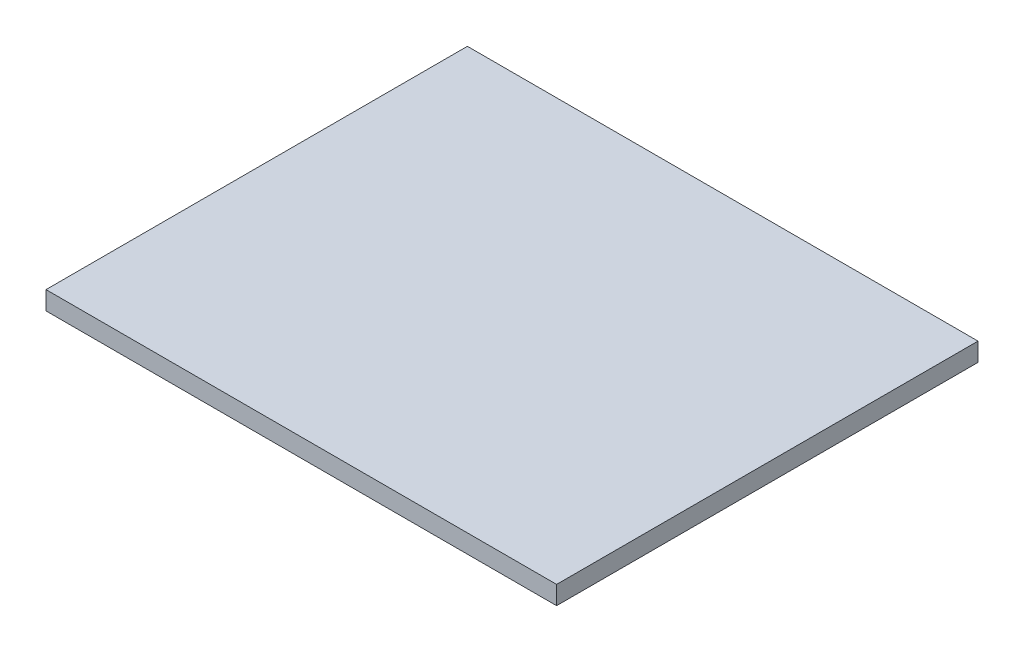
ISO-10303-21;
HEADER;
FILE_DESCRIPTION(('STEP AP214'),'2;1');
FILE_NAME('part.step','',(''),(''),'','','');
FILE_SCHEMA(('AUTOMOTIVE_DESIGN { 1 0 10303 214 1 1 1 1 }'));
ENDSEC;
DATA;
#1=APPLICATION_CONTEXT('core data for automotive mechanical design processes');
#2=APPLICATION_PROTOCOL_DEFINITION('international standard','automotive_design',2000,#1);
#3=PRODUCT_CONTEXT('',#1,'mechanical');
#4=PRODUCT('Part','Part','',(#3));
#5=PRODUCT_RELATED_PRODUCT_CATEGORY('part','',(#4));
#6=PRODUCT_DEFINITION_FORMATION('','',#4);
#7=PRODUCT_DEFINITION_CONTEXT('part definition',#1,'design');
#8=PRODUCT_DEFINITION('design','',#6,#7);
#9=PRODUCT_DEFINITION_SHAPE('','',#8);
#10=(LENGTH_UNIT() NAMED_UNIT(*) SI_UNIT(.MILLI.,.METRE.));
#11=(NAMED_UNIT(*) PLANE_ANGLE_UNIT() SI_UNIT($,.RADIAN.));
#12=(NAMED_UNIT(*) SI_UNIT($,.STERADIAN.) SOLID_ANGLE_UNIT());
#13=UNCERTAINTY_MEASURE_WITH_UNIT(LENGTH_MEASURE(1.E-05),#10,'distance_accuracy_value','');
#14=(GEOMETRIC_REPRESENTATION_CONTEXT(3) GLOBAL_UNCERTAINTY_ASSIGNED_CONTEXT((#13)) GLOBAL_UNIT_ASSIGNED_CONTEXT((#10,
#11,#12)) REPRESENTATION_CONTEXT('',''));
#15=CARTESIAN_POINT('',(0.,0.,0.));
#16=DIRECTION('',(0.,0.,1.));
#17=DIRECTION('',(1.,0.,0.));
#18=AXIS2_PLACEMENT_3D('',#15,#16,#17);
#19=CARTESIAN_POINT('',(124.8,-220.,68.5));
#20=DIRECTION('',(-1.,0.,0.));
#21=DIRECTION('',(0.,0.,1.));
#22=AXIS2_PLACEMENT_3D('',#19,#20,#21);
#23=PLANE('',#22);
#24=DIRECTION('',(0.,1.,0.));
#25=VECTOR('',#24,1.);
#26=CARTESIAN_POINT('',(124.8,-220.,0.));
#27=LINE('',#26,#25);
#28=CARTESIAN_POINT('',(124.8,-223.,0.));
#29=VERTEX_POINT('',#28);
#30=CARTESIAN_POINT('',(124.8,-220.,0.));
#31=VERTEX_POINT('',#30);
#32=EDGE_CURVE('E96',#29,#31,#27,.T.);
#33=ORIENTED_EDGE('',*,*,#32,.T.);
#34=DIRECTION('',(0.,0.,-1.));
#35=VECTOR('',#34,1.);
#36=CARTESIAN_POINT('',(124.8,-220.,68.5));
#37=LINE('',#36,#35);
#38=CARTESIAN_POINT('',(124.8,-220.,68.5));
#39=VERTEX_POINT('',#38);
#40=EDGE_CURVE('E11',#39,#31,#37,.T.);
#41=ORIENTED_EDGE('',*,*,#40,.F.);
#42=DIRECTION('',(0.,1.,0.));
#43=VECTOR('',#42,1.);
#44=CARTESIAN_POINT('',(124.8,-220.,68.5));
#45=LINE('',#44,#43);
#46=CARTESIAN_POINT('',(124.8,-223.,68.5));
#47=VERTEX_POINT('',#46);
#48=EDGE_CURVE('E84',#47,#39,#45,.T.);
#49=ORIENTED_EDGE('',*,*,#48,.F.);
#50=DIRECTION('',(0.,0.,-1.));
#51=VECTOR('',#50,1.);
#52=CARTESIAN_POINT('',(124.8,-223.,68.5));
#53=LINE('',#52,#51);
#54=EDGE_CURVE('E92',#47,#29,#53,.T.);
#55=ORIENTED_EDGE('',*,*,#54,.T.);
#56=EDGE_LOOP('',(#33,#41,#49,#55));
#57=FACE_BOUND('',#56,.T.);
#58=ADVANCED_FACE('F33',(#57),#23,.F.);
#59=CARTESIAN_POINT('',(124.8,-220.,68.5));
#60=DIRECTION('',(0.,-1.,0.));
#61=DIRECTION('',(0.,0.,-1.));
#62=AXIS2_PLACEMENT_3D('',#59,#60,#61);
#63=PLANE('',#62);
#64=DIRECTION('',(-1.,0.,0.));
#65=VECTOR('',#64,1.);
#66=CARTESIAN_POINT('',(124.8,-220.,0.));
#67=LINE('',#66,#65);
#68=CARTESIAN_POINT('',(41.8,-220.,0.));
#69=VERTEX_POINT('',#68);
#70=EDGE_CURVE('E88',#31,#69,#67,.T.);
#71=ORIENTED_EDGE('',*,*,#70,.T.);
#72=DIRECTION('',(0.,0.,-1.));
#73=VECTOR('',#72,1.);
#74=CARTESIAN_POINT('',(41.8,-220.,68.5));
#75=LINE('',#74,#73);
#76=CARTESIAN_POINT('',(41.8,-220.,68.5));
#77=VERTEX_POINT('',#76);
#78=EDGE_CURVE('E41',#77,#69,#75,.T.);
#79=ORIENTED_EDGE('',*,*,#78,.F.);
#80=DIRECTION('',(-1.,0.,0.));
#81=VECTOR('',#80,1.);
#82=CARTESIAN_POINT('',(124.8,-220.,68.5));
#83=LINE('',#82,#81);
#84=EDGE_CURVE('E79',#39,#77,#83,.T.);
#85=ORIENTED_EDGE('',*,*,#84,.F.);
#86=ORIENTED_EDGE('',*,*,#40,.T.);
#87=EDGE_LOOP('',(#71,#79,#85,#86));
#88=FACE_BOUND('',#87,.T.);
#89=ADVANCED_FACE('F87',(#88),#63,.F.);
#90=CARTESIAN_POINT('',(41.8,-220.,68.5));
#91=DIRECTION('',(1.,0.,0.));
#92=DIRECTION('',(0.,0.,-1.));
#93=AXIS2_PLACEMENT_3D('',#90,#91,#92);
#94=PLANE('',#93);
#95=DIRECTION('',(0.,-1.,0.));
#96=VECTOR('',#95,1.);
#97=CARTESIAN_POINT('',(41.8,-220.,0.));
#98=LINE('',#97,#96);
#99=CARTESIAN_POINT('',(41.8,-223.,0.));
#100=VERTEX_POINT('',#99);
#101=EDGE_CURVE('E66',#69,#100,#98,.T.);
#102=ORIENTED_EDGE('',*,*,#101,.T.);
#103=DIRECTION('',(0.,0.,-1.));
#104=VECTOR('',#103,1.);
#105=CARTESIAN_POINT('',(41.8,-223.,68.5));
#106=LINE('',#105,#104);
#107=CARTESIAN_POINT('',(41.8,-223.,68.5));
#108=VERTEX_POINT('',#107);
#109=EDGE_CURVE('E89',#108,#100,#106,.T.);
#110=ORIENTED_EDGE('',*,*,#109,.F.);
#111=DIRECTION('',(0.,-1.,0.));
#112=VECTOR('',#111,1.);
#113=CARTESIAN_POINT('',(41.8,-220.,68.5));
#114=LINE('',#113,#112);
#115=EDGE_CURVE('E82',#77,#108,#114,.T.);
#116=ORIENTED_EDGE('',*,*,#115,.F.);
#117=ORIENTED_EDGE('',*,*,#78,.T.);
#118=EDGE_LOOP('',(#102,#110,#116,#117));
#119=FACE_BOUND('',#118,.T.);
#120=ADVANCED_FACE('F90',(#119),#94,.F.);
#121=CARTESIAN_POINT('',(124.8,-223.,68.5));
#122=DIRECTION('',(0.,1.,0.));
#123=DIRECTION('',(0.,0.,1.));
#124=AXIS2_PLACEMENT_3D('',#121,#122,#123);
#125=PLANE('',#124);
#126=DIRECTION('',(1.,0.,0.));
#127=VECTOR('',#126,1.);
#128=CARTESIAN_POINT('',(124.8,-223.,0.));
#129=LINE('',#128,#127);
#130=EDGE_CURVE('E72',#100,#29,#129,.T.);
#131=ORIENTED_EDGE('',*,*,#130,.T.);
#132=ORIENTED_EDGE('',*,*,#54,.F.);
#133=DIRECTION('',(1.,0.,0.));
#134=VECTOR('',#133,1.);
#135=CARTESIAN_POINT('',(124.8,-223.,68.5));
#136=LINE('',#135,#134);
#137=EDGE_CURVE('E49',#108,#47,#136,.T.);
#138=ORIENTED_EDGE('',*,*,#137,.F.);
#139=ORIENTED_EDGE('',*,*,#109,.T.);
#140=EDGE_LOOP('',(#131,#132,#138,#139));
#141=FACE_BOUND('',#140,.T.);
#142=ADVANCED_FACE('F103',(#141),#125,.F.);
#143=CARTESIAN_POINT('',(0.,0.,68.5));
#144=DIRECTION('',(0.,0.,-1.));
#145=DIRECTION('',(-1.,0.,0.));
#146=AXIS2_PLACEMENT_3D('',#143,#144,#145);
#147=PLANE('',#146);
#148=ORIENTED_EDGE('',*,*,#48,.T.);
#149=ORIENTED_EDGE('',*,*,#84,.T.);
#150=ORIENTED_EDGE('',*,*,#115,.T.);
#151=ORIENTED_EDGE('',*,*,#137,.T.);
#152=EDGE_LOOP('',(#148,#149,#150,#151));
#153=FACE_BOUND('',#152,.T.);
#154=ADVANCED_FACE('F80',(#153),#147,.F.);
#155=CARTESIAN_POINT('',(0.,0.,0.));
#156=DIRECTION('',(0.,0.,-1.));
#157=DIRECTION('',(-1.,0.,0.));
#158=AXIS2_PLACEMENT_3D('',#155,#156,#157);
#159=PLANE('',#158);
#160=ORIENTED_EDGE('',*,*,#32,.F.);
#161=ORIENTED_EDGE('',*,*,#130,.F.);
#162=ORIENTED_EDGE('',*,*,#101,.F.);
#163=ORIENTED_EDGE('',*,*,#70,.F.);
#164=EDGE_LOOP('',(#160,#161,#162,#163));
#165=FACE_BOUND('',#164,.T.);
#166=ADVANCED_FACE('F106',(#165),#159,.T.);
#167=CLOSED_SHELL('',(#58,#89,#120,#142,#154,#166));
#168=MANIFOLD_SOLID_BREP('B2',#167);
#169=ADVANCED_BREP_SHAPE_REPRESENTATION('',(#18,#168),#14);
#170=SHAPE_DEFINITION_REPRESENTATION(#9,#169);
ENDSEC;
END-ISO-10303-21;
